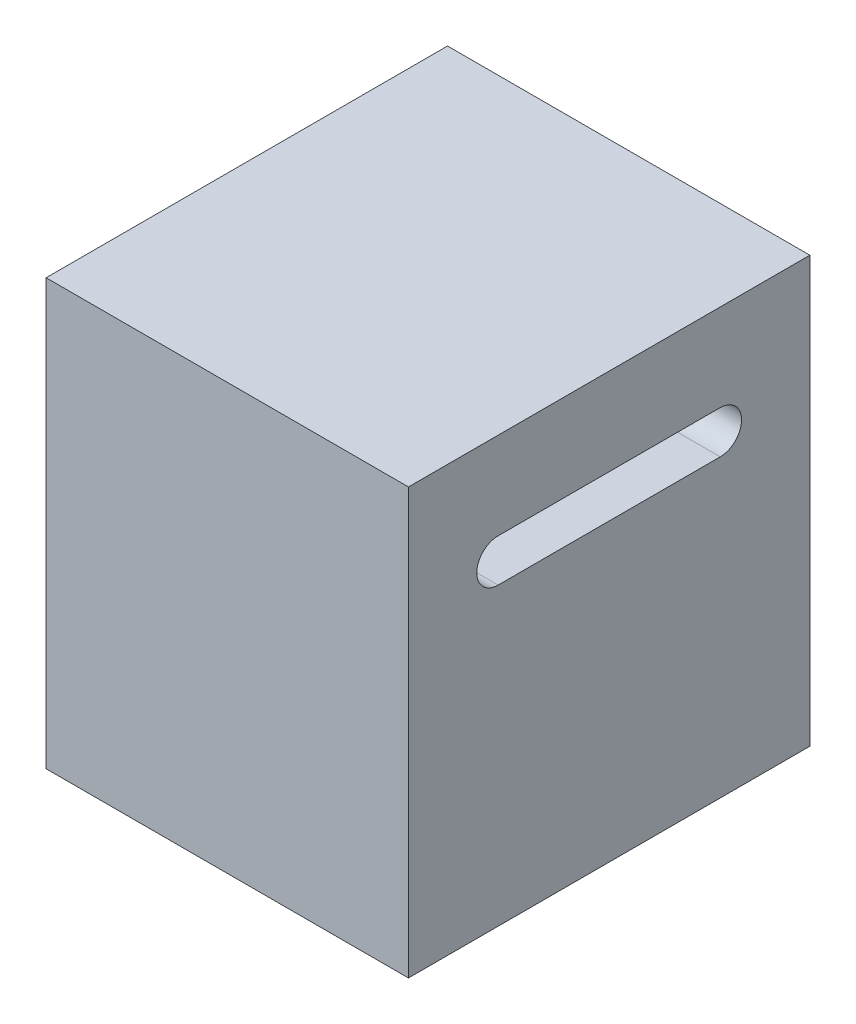
ISO-10303-21;
HEADER;
FILE_DESCRIPTION(('STEP AP214'),'2;1');
FILE_NAME('part.step','',(''),(''),'','','');
FILE_SCHEMA(('AUTOMOTIVE_DESIGN { 1 0 10303 214 1 1 1 1 }'));
ENDSEC;
DATA;
#1=APPLICATION_CONTEXT('core data for automotive mechanical design processes');
#2=APPLICATION_PROTOCOL_DEFINITION('international standard','automotive_design',2000,#1);
#3=PRODUCT_CONTEXT('',#1,'mechanical');
#4=PRODUCT('Part','Part','',(#3));
#5=PRODUCT_RELATED_PRODUCT_CATEGORY('part','',(#4));
#6=PRODUCT_DEFINITION_FORMATION('','',#4);
#7=PRODUCT_DEFINITION_CONTEXT('part definition',#1,'design');
#8=PRODUCT_DEFINITION('design','',#6,#7);
#9=PRODUCT_DEFINITION_SHAPE('','',#8);
#10=(LENGTH_UNIT() NAMED_UNIT(*) SI_UNIT(.MILLI.,.METRE.));
#11=(NAMED_UNIT(*) PLANE_ANGLE_UNIT() SI_UNIT($,.RADIAN.));
#12=(NAMED_UNIT(*) SI_UNIT($,.STERADIAN.) SOLID_ANGLE_UNIT());
#13=UNCERTAINTY_MEASURE_WITH_UNIT(LENGTH_MEASURE(1.E-05),#10,'distance_accuracy_value','');
#14=(GEOMETRIC_REPRESENTATION_CONTEXT(3) GLOBAL_UNCERTAINTY_ASSIGNED_CONTEXT((#13)) GLOBAL_UNIT_ASSIGNED_CONTEXT((#10,
#11,#12)) REPRESENTATION_CONTEXT('',''));
#15=CARTESIAN_POINT('',(0.,0.,0.));
#16=DIRECTION('',(0.,0.,1.));
#17=DIRECTION('',(1.,0.,0.));
#18=AXIS2_PLACEMENT_3D('',#15,#16,#17);
#19=CARTESIAN_POINT('',(0.,49.784,0.));
#20=DIRECTION('',(1.,0.,0.));
#21=DIRECTION('',(0.,0.,-1.));
#22=AXIS2_PLACEMENT_3D('',#19,#20,#21);
#23=PLANE('',#22);
#24=DIRECTION('',(0.,0.,1.));
#25=VECTOR('',#24,1.);
#26=CARTESIAN_POINT('',(0.,39.5801129997098,-10.495));
#27=LINE('',#26,#25);
#28=CARTESIAN_POINT('',(0.,39.5801129997098,-36.495));
#29=VERTEX_POINT('',#28);
#30=CARTESIAN_POINT('',(0.,39.5801129997098,-10.495));
#31=VERTEX_POINT('',#30);
#32=EDGE_CURVE('E113',#29,#31,#27,.T.);
#33=ORIENTED_EDGE('',*,*,#32,.T.);
#34=CARTESIAN_POINT('',(0.,37.084,-10.495));
#35=DIRECTION('',(1.,0.,0.));
#36=DIRECTION('',(0.,0.,-1.));
#37=AXIS2_PLACEMENT_3D('',#34,#35,#36);
#38=CIRCLE('',#37,2.49611299970985);
#39=CARTESIAN_POINT('',(0.,34.5878870002901,-10.495));
#40=VERTEX_POINT('',#39);
#41=EDGE_CURVE('E106',#31,#40,#38,.T.);
#42=ORIENTED_EDGE('',*,*,#41,.T.);
#43=DIRECTION('',(0.,0.,-1.));
#44=VECTOR('',#43,1.);
#45=CARTESIAN_POINT('',(0.,34.5878870002901,-10.495));
#46=LINE('',#45,#44);
#47=CARTESIAN_POINT('',(0.,34.5878870002901,-36.495));
#48=VERTEX_POINT('',#47);
#49=EDGE_CURVE('E116',#40,#48,#46,.T.);
#50=ORIENTED_EDGE('',*,*,#49,.T.);
#51=CARTESIAN_POINT('',(0.,37.084,-36.495));
#52=DIRECTION('',(1.,0.,0.));
#53=DIRECTION('',(0.,0.,-1.));
#54=AXIS2_PLACEMENT_3D('',#51,#52,#53);
#55=CIRCLE('',#54,2.49611299970985);
#56=EDGE_CURVE('E54',#48,#29,#55,.T.);
#57=ORIENTED_EDGE('',*,*,#56,.T.);
#58=EDGE_LOOP('',(#33,#42,#50,#57));
#59=FACE_BOUND('',#58,.T.);
#60=DIRECTION('',(0.,0.,1.));
#61=VECTOR('',#60,1.);
#62=CARTESIAN_POINT('',(0.,0.,0.));
#63=LINE('',#62,#61);
#64=CARTESIAN_POINT('',(0.,0.,-46.99));
#65=VERTEX_POINT('',#64);
#66=CARTESIAN_POINT('',(0.,0.,0.));
#67=VERTEX_POINT('',#66);
#68=EDGE_CURVE('E146',#65,#67,#63,.T.);
#69=ORIENTED_EDGE('',*,*,#68,.T.);
#70=DIRECTION('',(0.,-1.,0.));
#71=VECTOR('',#70,1.);
#72=CARTESIAN_POINT('',(0.,49.784,0.));
#73=LINE('',#72,#71);
#74=CARTESIAN_POINT('',(0.,49.784,0.));
#75=VERTEX_POINT('',#74);
#76=EDGE_CURVE('E11',#75,#67,#73,.T.);
#77=ORIENTED_EDGE('',*,*,#76,.F.);
#78=DIRECTION('',(0.,0.,1.));
#79=VECTOR('',#78,1.);
#80=CARTESIAN_POINT('',(0.,49.784,0.));
#81=LINE('',#80,#79);
#82=CARTESIAN_POINT('',(0.,49.784,-46.99));
#83=VERTEX_POINT('',#82);
#84=EDGE_CURVE('E152',#83,#75,#81,.T.);
#85=ORIENTED_EDGE('',*,*,#84,.F.);
#86=DIRECTION('',(0.,-1.,0.));
#87=VECTOR('',#86,1.);
#88=CARTESIAN_POINT('',(0.,49.784,-46.99));
#89=LINE('',#88,#87);
#90=EDGE_CURVE('E166',#83,#65,#89,.T.);
#91=ORIENTED_EDGE('',*,*,#90,.T.);
#92=EDGE_LOOP('',(#69,#77,#85,#91));
#93=FACE_BOUND('',#92,.T.);
#94=ADVANCED_FACE('F39',(#59,#93),#23,.F.);
#95=CARTESIAN_POINT('',(0.,49.784,0.));
#96=DIRECTION('',(0.,0.,-1.));
#97=DIRECTION('',(-1.,0.,0.));
#98=AXIS2_PLACEMENT_3D('',#95,#96,#97);
#99=PLANE('',#98);
#100=DIRECTION('',(1.,0.,0.));
#101=VECTOR('',#100,1.);
#102=CARTESIAN_POINT('',(0.,0.,0.));
#103=LINE('',#102,#101);
#104=CARTESIAN_POINT('',(42.418,0.,0.));
#105=VERTEX_POINT('',#104);
#106=EDGE_CURVE('E170',#67,#105,#103,.T.);
#107=ORIENTED_EDGE('',*,*,#106,.T.);
#108=DIRECTION('',(0.,-1.,0.));
#109=VECTOR('',#108,1.);
#110=CARTESIAN_POINT('',(42.418,49.784,0.));
#111=LINE('',#110,#109);
#112=CARTESIAN_POINT('',(42.418,49.784,0.));
#113=VERTEX_POINT('',#112);
#114=EDGE_CURVE('E47',#113,#105,#111,.T.);
#115=ORIENTED_EDGE('',*,*,#114,.F.);
#116=DIRECTION('',(1.,0.,0.));
#117=VECTOR('',#116,1.);
#118=CARTESIAN_POINT('',(0.,49.784,0.));
#119=LINE('',#118,#117);
#120=EDGE_CURVE('E156',#75,#113,#119,.T.);
#121=ORIENTED_EDGE('',*,*,#120,.F.);
#122=ORIENTED_EDGE('',*,*,#76,.T.);
#123=EDGE_LOOP('',(#107,#115,#121,#122));
#124=FACE_BOUND('',#123,.T.);
#125=ADVANCED_FACE('F205',(#124),#99,.F.);
#126=CARTESIAN_POINT('',(42.418,49.784,0.));
#127=DIRECTION('',(-1.,0.,0.));
#128=DIRECTION('',(0.,0.,1.));
#129=AXIS2_PLACEMENT_3D('',#126,#127,#128);
#130=PLANE('',#129);
#131=DIRECTION('',(0.,0.,-1.));
#132=VECTOR('',#131,1.);
#133=CARTESIAN_POINT('',(42.418,34.5878870002901,-10.495));
#134=LINE('',#133,#132);
#135=CARTESIAN_POINT('',(42.418,34.5878870002901,-10.495));
#136=VERTEX_POINT('',#135);
#137=CARTESIAN_POINT('',(42.418,34.5878870002902,-36.495));
#138=VERTEX_POINT('',#137);
#139=EDGE_CURVE('E137',#136,#138,#134,.T.);
#140=ORIENTED_EDGE('',*,*,#139,.F.);
#141=CARTESIAN_POINT('',(42.418,37.084,-10.495));
#142=DIRECTION('',(1.,0.,0.));
#143=DIRECTION('',(0.,0.,-1.));
#144=AXIS2_PLACEMENT_3D('',#141,#142,#143);
#145=CIRCLE('',#144,2.49611299970985);
#146=CARTESIAN_POINT('',(42.418,39.5801129997098,-10.495));
#147=VERTEX_POINT('',#146);
#148=EDGE_CURVE('E62',#147,#136,#145,.T.);
#149=ORIENTED_EDGE('',*,*,#148,.F.);
#150=DIRECTION('',(0.,0.,1.));
#151=VECTOR('',#150,1.);
#152=CARTESIAN_POINT('',(42.418,39.5801129997098,-10.495));
#153=LINE('',#152,#151);
#154=CARTESIAN_POINT('',(42.418,39.5801129997098,-36.495));
#155=VERTEX_POINT('',#154);
#156=EDGE_CURVE('E124',#155,#147,#153,.T.);
#157=ORIENTED_EDGE('',*,*,#156,.F.);
#158=CARTESIAN_POINT('',(42.418,37.084,-36.495));
#159=DIRECTION('',(1.,0.,0.));
#160=DIRECTION('',(0.,0.,-1.));
#161=AXIS2_PLACEMENT_3D('',#158,#159,#160);
#162=CIRCLE('',#161,2.49611299970985);
#163=EDGE_CURVE('E128',#138,#155,#162,.T.);
#164=ORIENTED_EDGE('',*,*,#163,.F.);
#165=EDGE_LOOP('',(#140,#149,#157,#164));
#166=FACE_BOUND('',#165,.T.);
#167=DIRECTION('',(0.,0.,-1.));
#168=VECTOR('',#167,1.);
#169=CARTESIAN_POINT('',(42.418,0.,0.));
#170=LINE('',#169,#168);
#171=CARTESIAN_POINT('',(42.418,0.,-46.99));
#172=VERTEX_POINT('',#171);
#173=EDGE_CURVE('E173',#105,#172,#170,.T.);
#174=ORIENTED_EDGE('',*,*,#173,.T.);
#175=DIRECTION('',(0.,-1.,0.));
#176=VECTOR('',#175,1.);
#177=CARTESIAN_POINT('',(42.418,49.784,-46.99));
#178=LINE('',#177,#176);
#179=CARTESIAN_POINT('',(42.418,49.784,-46.99));
#180=VERTEX_POINT('',#179);
#181=EDGE_CURVE('E181',#180,#172,#178,.T.);
#182=ORIENTED_EDGE('',*,*,#181,.F.);
#183=DIRECTION('',(0.,0.,-1.));
#184=VECTOR('',#183,1.);
#185=CARTESIAN_POINT('',(42.418,49.784,0.));
#186=LINE('',#185,#184);
#187=EDGE_CURVE('E160',#113,#180,#186,.T.);
#188=ORIENTED_EDGE('',*,*,#187,.F.);
#189=ORIENTED_EDGE('',*,*,#114,.T.);
#190=EDGE_LOOP('',(#174,#182,#188,#189));
#191=FACE_BOUND('',#190,.T.);
#192=ADVANCED_FACE('F190',(#166,#191),#130,.F.);
#193=CARTESIAN_POINT('',(0.,49.784,-46.99));
#194=DIRECTION('',(0.,0.,1.));
#195=DIRECTION('',(1.,0.,0.));
#196=AXIS2_PLACEMENT_3D('',#193,#194,#195);
#197=PLANE('',#196);
#198=DIRECTION('',(-1.,0.,0.));
#199=VECTOR('',#198,1.);
#200=CARTESIAN_POINT('',(0.,0.,-46.99));
#201=LINE('',#200,#199);
#202=EDGE_CURVE('E157',#172,#65,#201,.T.);
#203=ORIENTED_EDGE('',*,*,#202,.T.);
#204=ORIENTED_EDGE('',*,*,#90,.F.);
#205=DIRECTION('',(-1.,0.,0.));
#206=VECTOR('',#205,1.);
#207=CARTESIAN_POINT('',(0.,49.784,-46.99));
#208=LINE('',#207,#206);
#209=EDGE_CURVE('E163',#180,#83,#208,.T.);
#210=ORIENTED_EDGE('',*,*,#209,.F.);
#211=ORIENTED_EDGE('',*,*,#181,.T.);
#212=EDGE_LOOP('',(#203,#204,#210,#211));
#213=FACE_BOUND('',#212,.T.);
#214=ADVANCED_FACE('F199',(#213),#197,.F.);
#215=CARTESIAN_POINT('',(0.,49.784,0.));
#216=DIRECTION('',(0.,-1.,0.));
#217=DIRECTION('',(0.,0.,-1.));
#218=AXIS2_PLACEMENT_3D('',#215,#216,#217);
#219=PLANE('',#218);
#220=ORIENTED_EDGE('',*,*,#84,.T.);
#221=ORIENTED_EDGE('',*,*,#120,.T.);
#222=ORIENTED_EDGE('',*,*,#187,.T.);
#223=ORIENTED_EDGE('',*,*,#209,.T.);
#224=EDGE_LOOP('',(#220,#221,#222,#223));
#225=FACE_BOUND('',#224,.T.);
#226=ADVANCED_FACE('F204',(#225),#219,.F.);
#227=CARTESIAN_POINT('',(0.,0.,0.));
#228=DIRECTION('',(0.,-1.,0.));
#229=DIRECTION('',(0.,0.,-1.));
#230=AXIS2_PLACEMENT_3D('',#227,#228,#229);
#231=PLANE('',#230);
#232=ORIENTED_EDGE('',*,*,#68,.F.);
#233=ORIENTED_EDGE('',*,*,#202,.F.);
#234=ORIENTED_EDGE('',*,*,#173,.F.);
#235=ORIENTED_EDGE('',*,*,#106,.F.);
#236=EDGE_LOOP('',(#232,#233,#234,#235));
#237=FACE_BOUND('',#236,.T.);
#238=ADVANCED_FACE('F196',(#237),#231,.T.);
#239=CARTESIAN_POINT('',(0.,37.084,-10.495));
#240=DIRECTION('',(1.,0.,0.));
#241=DIRECTION('',(0.,0.,-1.));
#242=AXIS2_PLACEMENT_3D('',#239,#240,#241);
#243=CYLINDRICAL_SURFACE('',#242,2.49611299970985);
#244=ORIENTED_EDGE('',*,*,#148,.T.);
#245=DIRECTION('',(1.,0.,0.));
#246=VECTOR('',#245,1.);
#247=CARTESIAN_POINT('',(0.,34.5878870002901,-10.495));
#248=LINE('',#247,#246);
#249=EDGE_CURVE('E102',#40,#136,#248,.T.);
#250=ORIENTED_EDGE('',*,*,#249,.F.);
#251=ORIENTED_EDGE('',*,*,#41,.F.);
#252=DIRECTION('',(1.,0.,0.));
#253=VECTOR('',#252,1.);
#254=CARTESIAN_POINT('',(0.,39.5801129997098,-10.495));
#255=LINE('',#254,#253);
#256=EDGE_CURVE('E143',#31,#147,#255,.T.);
#257=ORIENTED_EDGE('',*,*,#256,.T.);
#258=EDGE_LOOP('',(#244,#250,#251,#257));
#259=FACE_BOUND('',#258,.T.);
#260=ADVANCED_FACE('F104',(#259),#243,.F.);
#261=CARTESIAN_POINT('',(0.,39.5801129997098,-10.495));
#262=DIRECTION('',(0.,1.,0.));
#263=DIRECTION('',(0.,0.,1.));
#264=AXIS2_PLACEMENT_3D('',#261,#262,#263);
#265=PLANE('',#264);
#266=ORIENTED_EDGE('',*,*,#156,.T.);
#267=ORIENTED_EDGE('',*,*,#256,.F.);
#268=ORIENTED_EDGE('',*,*,#32,.F.);
#269=DIRECTION('',(1.,0.,0.));
#270=VECTOR('',#269,1.);
#271=CARTESIAN_POINT('',(0.,39.5801129997098,-36.495));
#272=LINE('',#271,#270);
#273=EDGE_CURVE('E147',#29,#155,#272,.T.);
#274=ORIENTED_EDGE('',*,*,#273,.T.);
#275=EDGE_LOOP('',(#266,#267,#268,#274));
#276=FACE_BOUND('',#275,.T.);
#277=ADVANCED_FACE('F222',(#276),#265,.F.);
#278=CARTESIAN_POINT('',(0.,37.084,-36.495));
#279=DIRECTION('',(1.,0.,0.));
#280=DIRECTION('',(0.,0.,-1.));
#281=AXIS2_PLACEMENT_3D('',#278,#279,#280);
#282=CYLINDRICAL_SURFACE('',#281,2.49611299970985);
#283=ORIENTED_EDGE('',*,*,#163,.T.);
#284=ORIENTED_EDGE('',*,*,#273,.F.);
#285=ORIENTED_EDGE('',*,*,#56,.F.);
#286=DIRECTION('',(1.,0.,0.));
#287=VECTOR('',#286,1.);
#288=CARTESIAN_POINT('',(0.,34.5878870002902,-36.495));
#289=LINE('',#288,#287);
#290=EDGE_CURVE('E112',#48,#138,#289,.T.);
#291=ORIENTED_EDGE('',*,*,#290,.T.);
#292=EDGE_LOOP('',(#283,#284,#285,#291));
#293=FACE_BOUND('',#292,.T.);
#294=ADVANCED_FACE('F225',(#293),#282,.F.);
#295=CARTESIAN_POINT('',(0.,34.5878870002901,-10.495));
#296=DIRECTION('',(0.,-1.,0.));
#297=DIRECTION('',(0.,0.,-1.));
#298=AXIS2_PLACEMENT_3D('',#295,#296,#297);
#299=PLANE('',#298);
#300=ORIENTED_EDGE('',*,*,#139,.T.);
#301=ORIENTED_EDGE('',*,*,#290,.F.);
#302=ORIENTED_EDGE('',*,*,#49,.F.);
#303=ORIENTED_EDGE('',*,*,#249,.T.);
#304=EDGE_LOOP('',(#300,#301,#302,#303));
#305=FACE_BOUND('',#304,.T.);
#306=ADVANCED_FACE('F117',(#305),#299,.F.);
#307=CLOSED_SHELL('',(#94,#125,#192,#214,#226,#238,#260,#277,#294,#306));
#308=MANIFOLD_SOLID_BREP('B2',#307);
#309=ADVANCED_BREP_SHAPE_REPRESENTATION('',(#18,#308),#14);
#310=SHAPE_DEFINITION_REPRESENTATION(#9,#309);
ENDSEC;
END-ISO-10303-21;
